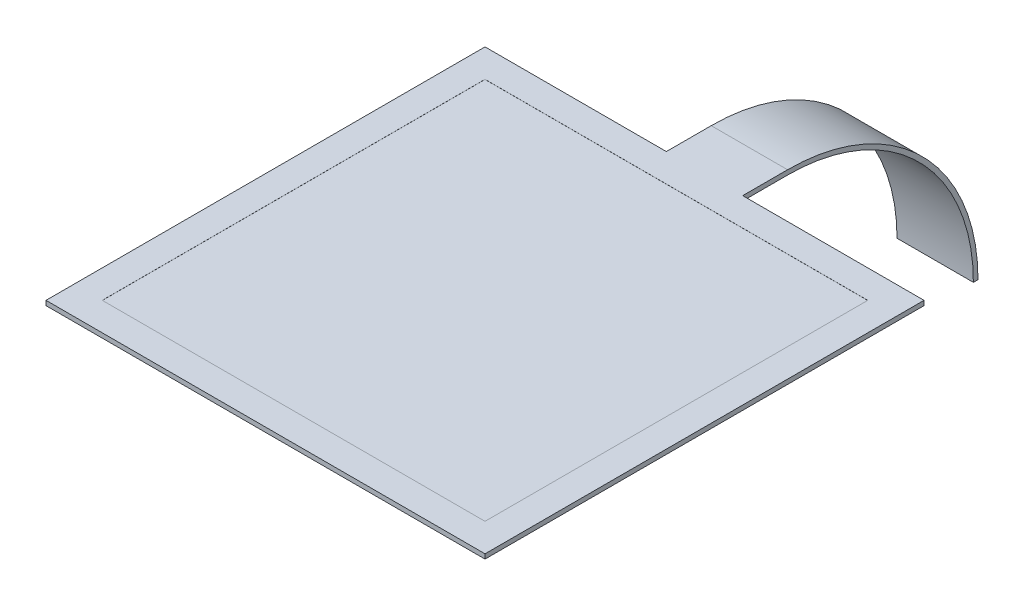
ISO-10303-21;
HEADER;
FILE_DESCRIPTION(('STEP AP214'),'2;1');
FILE_NAME('part.step','',(''),(''),'','','');
FILE_SCHEMA(('AUTOMOTIVE_DESIGN { 1 0 10303 214 1 1 1 1 }'));
ENDSEC;
DATA;
#1=APPLICATION_CONTEXT('core data for automotive mechanical design processes');
#2=APPLICATION_PROTOCOL_DEFINITION('international standard','automotive_design',2000,#1);
#3=PRODUCT_CONTEXT('',#1,'mechanical');
#4=PRODUCT('Part','Part','',(#3));
#5=PRODUCT_RELATED_PRODUCT_CATEGORY('part','',(#4));
#6=PRODUCT_DEFINITION_FORMATION('','',#4);
#7=PRODUCT_DEFINITION_CONTEXT('part definition',#1,'design');
#8=PRODUCT_DEFINITION('design','',#6,#7);
#9=PRODUCT_DEFINITION_SHAPE('','',#8);
#10=(LENGTH_UNIT() NAMED_UNIT(*) SI_UNIT(.MILLI.,.METRE.));
#11=(NAMED_UNIT(*) PLANE_ANGLE_UNIT() SI_UNIT($,.RADIAN.));
#12=(NAMED_UNIT(*) SI_UNIT($,.STERADIAN.) SOLID_ANGLE_UNIT());
#13=UNCERTAINTY_MEASURE_WITH_UNIT(LENGTH_MEASURE(1.E-05),#10,'distance_accuracy_value','');
#14=(GEOMETRIC_REPRESENTATION_CONTEXT(3) GLOBAL_UNCERTAINTY_ASSIGNED_CONTEXT((#13)) GLOBAL_UNIT_ASSIGNED_CONTEXT((#10,
#11,#12)) REPRESENTATION_CONTEXT('',''));
#15=CARTESIAN_POINT('',(0.,0.,0.));
#16=DIRECTION('',(0.,0.,1.));
#17=DIRECTION('',(1.,0.,0.));
#18=AXIS2_PLACEMENT_3D('',#15,#16,#17);
#19=CARTESIAN_POINT('',(21.85,0.23,21.85));
#20=DIRECTION('',(0.,1.,0.));
#21=DIRECTION('',(0.,0.,1.));
#22=AXIS2_PLACEMENT_3D('',#19,#20,#21);
#23=PLANE('',#22);
#24=DIRECTION('',(0.,0.,-1.));
#25=VECTOR('',#24,1.);
#26=CARTESIAN_POINT('',(19.05,0.23,19.05));
#27=LINE('',#26,#25);
#28=CARTESIAN_POINT('',(19.05,0.23,19.05));
#29=VERTEX_POINT('',#28);
#30=CARTESIAN_POINT('',(19.05,0.23,-19.05));
#31=VERTEX_POINT('',#30);
#32=EDGE_CURVE('E58',#29,#31,#27,.T.);
#33=ORIENTED_EDGE('',*,*,#32,.F.);
#34=DIRECTION('',(1.,0.,0.));
#35=VECTOR('',#34,1.);
#36=CARTESIAN_POINT('',(-19.05,0.23,19.05));
#37=LINE('',#36,#35);
#38=CARTESIAN_POINT('',(-19.05,0.23,19.05));
#39=VERTEX_POINT('',#38);
#40=EDGE_CURVE('E226',#39,#29,#37,.T.);
#41=ORIENTED_EDGE('',*,*,#40,.F.);
#42=DIRECTION('',(0.,0.,1.));
#43=VECTOR('',#42,1.);
#44=CARTESIAN_POINT('',(-19.05,0.23,19.05));
#45=LINE('',#44,#43);
#46=CARTESIAN_POINT('',(-19.05,0.23,-19.05));
#47=VERTEX_POINT('',#46);
#48=EDGE_CURVE('E240',#47,#39,#45,.T.);
#49=ORIENTED_EDGE('',*,*,#48,.F.);
#50=DIRECTION('',(-1.,0.,0.));
#51=VECTOR('',#50,1.);
#52=CARTESIAN_POINT('',(-19.05,0.23,-19.05));
#53=LINE('',#52,#51);
#54=EDGE_CURVE('E237',#31,#47,#53,.T.);
#55=ORIENTED_EDGE('',*,*,#54,.F.);
#56=EDGE_LOOP('',(#33,#41,#49,#55));
#57=FACE_BOUND('',#56,.T.);
#58=DIRECTION('',(0.,0.,-1.));
#59=VECTOR('',#58,1.);
#60=CARTESIAN_POINT('',(3.8,0.23,-21.85));
#61=LINE('',#60,#59);
#62=CARTESIAN_POINT('',(3.8,0.23,-21.85));
#63=VERTEX_POINT('',#62);
#64=CARTESIAN_POINT('',(3.8,0.230000000000001,-26.3155843490718));
#65=VERTEX_POINT('',#64);
#66=EDGE_CURVE('E153',#63,#65,#61,.T.);
#67=ORIENTED_EDGE('',*,*,#66,.T.);
#68=DIRECTION('',(1.,0.,0.));
#69=VECTOR('',#68,1.);
#70=CARTESIAN_POINT('',(-3.8,0.230000000000001,-26.3155843490718));
#71=LINE('',#70,#69);
#72=CARTESIAN_POINT('',(-3.8,0.230000000000001,-26.3155843490718));
#73=VERTEX_POINT('',#72);
#74=EDGE_CURVE('E141',#73,#65,#71,.T.);
#75=ORIENTED_EDGE('',*,*,#74,.F.);
#76=DIRECTION('',(0.,0.,1.));
#77=VECTOR('',#76,1.);
#78=CARTESIAN_POINT('',(-3.8,0.23,-21.85));
#79=LINE('',#78,#77);
#80=CARTESIAN_POINT('',(-3.8,0.23,-21.85));
#81=VERTEX_POINT('',#80);
#82=EDGE_CURVE('E150',#73,#81,#79,.T.);
#83=ORIENTED_EDGE('',*,*,#82,.T.);
#84=DIRECTION('',(-1.,0.,0.));
#85=VECTOR('',#84,1.);
#86=CARTESIAN_POINT('',(-21.85,0.23,-21.85));
#87=LINE('',#86,#85);
#88=CARTESIAN_POINT('',(-21.85,0.23,-21.85));
#89=VERTEX_POINT('',#88);
#90=EDGE_CURVE('E159',#81,#89,#87,.T.);
#91=ORIENTED_EDGE('',*,*,#90,.T.);
#92=DIRECTION('',(0.,0.,1.));
#93=VECTOR('',#92,1.);
#94=CARTESIAN_POINT('',(-21.85,0.23,-21.85));
#95=LINE('',#94,#93);
#96=CARTESIAN_POINT('',(-21.85,0.23,21.85));
#97=VERTEX_POINT('',#96);
#98=EDGE_CURVE('E161',#89,#97,#95,.T.);
#99=ORIENTED_EDGE('',*,*,#98,.T.);
#100=DIRECTION('',(1.,0.,0.));
#101=VECTOR('',#100,1.);
#102=CARTESIAN_POINT('',(-21.85,0.23,21.85));
#103=LINE('',#102,#101);
#104=CARTESIAN_POINT('',(21.85,0.23,21.85));
#105=VERTEX_POINT('',#104);
#106=EDGE_CURVE('E168',#97,#105,#103,.T.);
#107=ORIENTED_EDGE('',*,*,#106,.T.);
#108=DIRECTION('',(0.,0.,-1.));
#109=VECTOR('',#108,1.);
#110=CARTESIAN_POINT('',(21.85,0.23,-21.85));
#111=LINE('',#110,#109);
#112=CARTESIAN_POINT('',(21.85,0.23,-21.85));
#113=VERTEX_POINT('',#112);
#114=EDGE_CURVE('E188',#105,#113,#111,.T.);
#115=ORIENTED_EDGE('',*,*,#114,.T.);
#116=DIRECTION('',(-1.,0.,0.));
#117=VECTOR('',#116,1.);
#118=CARTESIAN_POINT('',(3.8,0.23,-21.85));
#119=LINE('',#118,#117);
#120=EDGE_CURVE('E163',#113,#63,#119,.T.);
#121=ORIENTED_EDGE('',*,*,#120,.T.);
#122=EDGE_LOOP('',(#67,#75,#83,#91,#99,#107,#115,#121));
#123=FACE_BOUND('',#122,.T.);
#124=ADVANCED_FACE('F35',(#57,#123),#23,.T.);
#125=CARTESIAN_POINT('',(21.85,-0.23,21.85));
#126=DIRECTION('',(0.,1.,0.));
#127=DIRECTION('',(0.,0.,1.));
#128=AXIS2_PLACEMENT_3D('',#125,#126,#127);
#129=PLANE('',#128);
#130=DIRECTION('',(-1.,0.,0.));
#131=VECTOR('',#130,1.);
#132=CARTESIAN_POINT('',(3.8,-0.230000000000001,-26.3155843490718));
#133=LINE('',#132,#131);
#134=CARTESIAN_POINT('',(3.8,-0.230000000000001,-26.3155843490718));
#135=VERTEX_POINT('',#134);
#136=CARTESIAN_POINT('',(-3.8,-0.23,-26.3155843490718));
#137=VERTEX_POINT('',#136);
#138=EDGE_CURVE('E209',#135,#137,#133,.T.);
#139=ORIENTED_EDGE('',*,*,#138,.F.);
#140=DIRECTION('',(0.,0.,-1.));
#141=VECTOR('',#140,1.);
#142=CARTESIAN_POINT('',(3.8,-0.23,-21.85));
#143=LINE('',#142,#141);
#144=CARTESIAN_POINT('',(3.8,-0.23,-21.85));
#145=VERTEX_POINT('',#144);
#146=EDGE_CURVE('E177',#145,#135,#143,.T.);
#147=ORIENTED_EDGE('',*,*,#146,.F.);
#148=DIRECTION('',(-1.,0.,0.));
#149=VECTOR('',#148,1.);
#150=CARTESIAN_POINT('',(3.8,-0.23,-21.85));
#151=LINE('',#150,#149);
#152=CARTESIAN_POINT('',(21.85,-0.23,-21.85));
#153=VERTEX_POINT('',#152);
#154=EDGE_CURVE('E174',#153,#145,#151,.T.);
#155=ORIENTED_EDGE('',*,*,#154,.F.);
#156=DIRECTION('',(0.,0.,-1.));
#157=VECTOR('',#156,1.);
#158=CARTESIAN_POINT('',(21.85,-0.23,-21.85));
#159=LINE('',#158,#157);
#160=CARTESIAN_POINT('',(21.85,-0.23,21.85));
#161=VERTEX_POINT('',#160);
#162=EDGE_CURVE('E171',#161,#153,#159,.T.);
#163=ORIENTED_EDGE('',*,*,#162,.F.);
#164=DIRECTION('',(1.,0.,0.));
#165=VECTOR('',#164,1.);
#166=CARTESIAN_POINT('',(-21.85,-0.23,21.85));
#167=LINE('',#166,#165);
#168=CARTESIAN_POINT('',(-21.85,-0.23,21.85));
#169=VERTEX_POINT('',#168);
#170=EDGE_CURVE('E186',#169,#161,#167,.T.);
#171=ORIENTED_EDGE('',*,*,#170,.F.);
#172=DIRECTION('',(0.,0.,1.));
#173=VECTOR('',#172,1.);
#174=CARTESIAN_POINT('',(-21.85,-0.23,-21.85));
#175=LINE('',#174,#173);
#176=CARTESIAN_POINT('',(-21.85,-0.23,-21.85));
#177=VERTEX_POINT('',#176);
#178=EDGE_CURVE('E184',#177,#169,#175,.T.);
#179=ORIENTED_EDGE('',*,*,#178,.F.);
#180=DIRECTION('',(-1.,0.,0.));
#181=VECTOR('',#180,1.);
#182=CARTESIAN_POINT('',(-21.85,-0.23,-21.85));
#183=LINE('',#182,#181);
#184=CARTESIAN_POINT('',(-3.8,-0.23,-21.85));
#185=VERTEX_POINT('',#184);
#186=EDGE_CURVE('E182',#185,#177,#183,.T.);
#187=ORIENTED_EDGE('',*,*,#186,.F.);
#188=DIRECTION('',(0.,0.,1.));
#189=VECTOR('',#188,1.);
#190=CARTESIAN_POINT('',(-3.8,-0.23,-21.85));
#191=LINE('',#190,#189);
#192=EDGE_CURVE('E180',#137,#185,#191,.T.);
#193=ORIENTED_EDGE('',*,*,#192,.F.);
#194=EDGE_LOOP('',(#139,#147,#155,#163,#171,#179,#187,#193));
#195=FACE_BOUND('',#194,.T.);
#196=ADVANCED_FACE('F206',(#195),#129,.F.);
#197=CARTESIAN_POINT('',(21.85,0.23,-21.85));
#198=DIRECTION('',(-1.,0.,0.));
#199=DIRECTION('',(0.,0.,1.));
#200=AXIS2_PLACEMENT_3D('',#197,#198,#199);
#201=PLANE('',#200);
#202=ORIENTED_EDGE('',*,*,#162,.T.);
#203=DIRECTION('',(0.,-1.,0.));
#204=VECTOR('',#203,1.);
#205=CARTESIAN_POINT('',(21.85,0.23,-21.85));
#206=LINE('',#205,#204);
#207=EDGE_CURVE('E11',#113,#153,#206,.T.);
#208=ORIENTED_EDGE('',*,*,#207,.F.);
#209=ORIENTED_EDGE('',*,*,#114,.F.);
#210=DIRECTION('',(0.,-1.,0.));
#211=VECTOR('',#210,1.);
#212=CARTESIAN_POINT('',(21.85,0.23,21.85));
#213=LINE('',#212,#211);
#214=EDGE_CURVE('E170',#105,#161,#213,.T.);
#215=ORIENTED_EDGE('',*,*,#214,.T.);
#216=EDGE_LOOP('',(#202,#208,#209,#215));
#217=FACE_BOUND('',#216,.T.);
#218=ADVANCED_FACE('F37',(#217),#201,.F.);
#219=CARTESIAN_POINT('',(3.8,0.23,-21.85));
#220=DIRECTION('',(0.,0.,1.));
#221=DIRECTION('',(1.,0.,0.));
#222=AXIS2_PLACEMENT_3D('',#219,#220,#221);
#223=PLANE('',#222);
#224=ORIENTED_EDGE('',*,*,#154,.T.);
#225=DIRECTION('',(0.,-1.,0.));
#226=VECTOR('',#225,1.);
#227=CARTESIAN_POINT('',(3.8,0.23,-21.85));
#228=LINE('',#227,#226);
#229=EDGE_CURVE('E43',#63,#145,#228,.T.);
#230=ORIENTED_EDGE('',*,*,#229,.F.);
#231=ORIENTED_EDGE('',*,*,#120,.F.);
#232=ORIENTED_EDGE('',*,*,#207,.T.);
#233=EDGE_LOOP('',(#224,#230,#231,#232));
#234=FACE_BOUND('',#233,.T.);
#235=ADVANCED_FACE('F254',(#234),#223,.F.);
#236=CARTESIAN_POINT('',(3.8,0.23,-21.85));
#237=DIRECTION('',(-1.,0.,0.));
#238=DIRECTION('',(0.,0.,1.));
#239=AXIS2_PLACEMENT_3D('',#236,#237,#238);
#240=PLANE('',#239);
#241=CARTESIAN_POINT('',(3.8,-18.7262837167438,-26.3155843490718));
#242=DIRECTION('',(1.,0.,0.));
#243=DIRECTION('',(0.,0.,1.));
#244=AXIS2_PLACEMENT_3D('',#241,#242,#243);
#245=CIRCLE('',#244,18.9562837167438);
#246=CARTESIAN_POINT('',(3.8,-18.7262837167438,-45.2718680658157));
#247=VERTEX_POINT('',#246);
#248=EDGE_CURVE('E212',#247,#65,#245,.T.);
#249=ORIENTED_EDGE('',*,*,#248,.T.);
#250=ORIENTED_EDGE('',*,*,#66,.F.);
#251=ORIENTED_EDGE('',*,*,#229,.T.);
#252=ORIENTED_EDGE('',*,*,#146,.T.);
#253=CARTESIAN_POINT('',(3.8,-18.7262837167438,-26.3155843490718));
#254=DIRECTION('',(-1.,0.,0.));
#255=DIRECTION('',(0.,0.,1.));
#256=AXIS2_PLACEMENT_3D('',#253,#254,#255);
#257=CIRCLE('',#256,18.4962837167438);
#258=CARTESIAN_POINT('',(3.8,-18.7262837167438,-44.8118680658157));
#259=VERTEX_POINT('',#258);
#260=EDGE_CURVE('E146',#135,#259,#257,.T.);
#261=ORIENTED_EDGE('',*,*,#260,.T.);
#262=DIRECTION('',(0.,0.,-1.));
#263=VECTOR('',#262,1.);
#264=CARTESIAN_POINT('',(3.8,-18.7262837167438,-44.8118680658157));
#265=LINE('',#264,#263);
#266=EDGE_CURVE('E216',#259,#247,#265,.T.);
#267=ORIENTED_EDGE('',*,*,#266,.T.);
#268=EDGE_LOOP('',(#249,#250,#251,#252,#261,#267));
#269=FACE_BOUND('',#268,.T.);
#270=ADVANCED_FACE('F201',(#269),#240,.F.);
#271=CARTESIAN_POINT('',(-3.8,0.23,-21.85));
#272=DIRECTION('',(1.,0.,0.));
#273=DIRECTION('',(0.,0.,-1.));
#274=AXIS2_PLACEMENT_3D('',#271,#272,#273);
#275=PLANE('',#274);
#276=ORIENTED_EDGE('',*,*,#82,.F.);
#277=CARTESIAN_POINT('',(-3.8,-18.7262837167438,-26.3155843490718));
#278=DIRECTION('',(1.,0.,0.));
#279=DIRECTION('',(0.,0.,1.));
#280=AXIS2_PLACEMENT_3D('',#277,#278,#279);
#281=CIRCLE('',#280,18.9562837167438);
#282=CARTESIAN_POINT('',(-3.8,-18.7262837167438,-45.2718680658157));
#283=VERTEX_POINT('',#282);
#284=EDGE_CURVE('E137',#283,#73,#281,.T.);
#285=ORIENTED_EDGE('',*,*,#284,.F.);
#286=DIRECTION('',(0.,0.,-1.));
#287=VECTOR('',#286,1.);
#288=CARTESIAN_POINT('',(-3.8,-18.7262837167438,-44.8118680658157));
#289=LINE('',#288,#287);
#290=CARTESIAN_POINT('',(-3.8,-18.7262837167438,-44.8118680658157));
#291=VERTEX_POINT('',#290);
#292=EDGE_CURVE('E147',#291,#283,#289,.T.);
#293=ORIENTED_EDGE('',*,*,#292,.F.);
#294=CARTESIAN_POINT('',(-3.8,-18.7262837167438,-26.3155843490718));
#295=DIRECTION('',(-1.,0.,0.));
#296=DIRECTION('',(0.,0.,1.));
#297=AXIS2_PLACEMENT_3D('',#294,#295,#296);
#298=CIRCLE('',#297,18.4962837167438);
#299=EDGE_CURVE('E50',#137,#291,#298,.T.);
#300=ORIENTED_EDGE('',*,*,#299,.F.);
#301=ORIENTED_EDGE('',*,*,#192,.T.);
#302=DIRECTION('',(0.,-1.,0.));
#303=VECTOR('',#302,1.);
#304=CARTESIAN_POINT('',(-3.8,0.23,-21.85));
#305=LINE('',#304,#303);
#306=EDGE_CURVE('E157',#81,#185,#305,.T.);
#307=ORIENTED_EDGE('',*,*,#306,.F.);
#308=EDGE_LOOP('',(#276,#285,#293,#300,#301,#307));
#309=FACE_BOUND('',#308,.T.);
#310=ADVANCED_FACE('F155',(#309),#275,.F.);
#311=CARTESIAN_POINT('',(-21.85,0.23,-21.85));
#312=DIRECTION('',(0.,0.,1.));
#313=DIRECTION('',(1.,0.,0.));
#314=AXIS2_PLACEMENT_3D('',#311,#312,#313);
#315=PLANE('',#314);
#316=ORIENTED_EDGE('',*,*,#186,.T.);
#317=DIRECTION('',(0.,-1.,0.));
#318=VECTOR('',#317,1.);
#319=CARTESIAN_POINT('',(-21.85,0.23,-21.85));
#320=LINE('',#319,#318);
#321=EDGE_CURVE('E194',#89,#177,#320,.T.);
#322=ORIENTED_EDGE('',*,*,#321,.F.);
#323=ORIENTED_EDGE('',*,*,#90,.F.);
#324=ORIENTED_EDGE('',*,*,#306,.T.);
#325=EDGE_LOOP('',(#316,#322,#323,#324));
#326=FACE_BOUND('',#325,.T.);
#327=ADVANCED_FACE('F268',(#326),#315,.F.);
#328=CARTESIAN_POINT('',(-21.85,0.23,-21.85));
#329=DIRECTION('',(1.,0.,0.));
#330=DIRECTION('',(0.,0.,-1.));
#331=AXIS2_PLACEMENT_3D('',#328,#329,#330);
#332=PLANE('',#331);
#333=ORIENTED_EDGE('',*,*,#178,.T.);
#334=DIRECTION('',(0.,-1.,0.));
#335=VECTOR('',#334,1.);
#336=CARTESIAN_POINT('',(-21.85,0.23,21.85));
#337=LINE('',#336,#335);
#338=EDGE_CURVE('E191',#97,#169,#337,.T.);
#339=ORIENTED_EDGE('',*,*,#338,.F.);
#340=ORIENTED_EDGE('',*,*,#98,.F.);
#341=ORIENTED_EDGE('',*,*,#321,.T.);
#342=EDGE_LOOP('',(#333,#339,#340,#341));
#343=FACE_BOUND('',#342,.T.);
#344=ADVANCED_FACE('F265',(#343),#332,.F.);
#345=CARTESIAN_POINT('',(-21.85,0.23,21.85));
#346=DIRECTION('',(0.,0.,-1.));
#347=DIRECTION('',(-1.,0.,0.));
#348=AXIS2_PLACEMENT_3D('',#345,#346,#347);
#349=PLANE('',#348);
#350=ORIENTED_EDGE('',*,*,#170,.T.);
#351=ORIENTED_EDGE('',*,*,#214,.F.);
#352=ORIENTED_EDGE('',*,*,#106,.F.);
#353=ORIENTED_EDGE('',*,*,#338,.T.);
#354=EDGE_LOOP('',(#350,#351,#352,#353));
#355=FACE_BOUND('',#354,.T.);
#356=ADVANCED_FACE('F260',(#355),#349,.F.);
#357=CARTESIAN_POINT('',(19.05,0.22,19.05));
#358=DIRECTION('',(1.,0.,0.));
#359=DIRECTION('',(0.,0.,-1.));
#360=AXIS2_PLACEMENT_3D('',#357,#358,#359);
#361=PLANE('',#360);
#362=ORIENTED_EDGE('',*,*,#32,.T.);
#363=DIRECTION('',(0.,1.,0.));
#364=VECTOR('',#363,1.);
#365=CARTESIAN_POINT('',(19.05,0.22,-19.05));
#366=LINE('',#365,#364);
#367=CARTESIAN_POINT('',(19.05,0.22,-19.05));
#368=VERTEX_POINT('',#367);
#369=EDGE_CURVE('E235',#368,#31,#366,.T.);
#370=ORIENTED_EDGE('',*,*,#369,.F.);
#371=DIRECTION('',(0.,0.,-1.));
#372=VECTOR('',#371,1.);
#373=CARTESIAN_POINT('',(19.05,0.22,19.05));
#374=LINE('',#373,#372);
#375=CARTESIAN_POINT('',(19.05,0.22,19.05));
#376=VERTEX_POINT('',#375);
#377=EDGE_CURVE('E222',#376,#368,#374,.T.);
#378=ORIENTED_EDGE('',*,*,#377,.F.);
#379=DIRECTION('',(0.,1.,0.));
#380=VECTOR('',#379,1.);
#381=CARTESIAN_POINT('',(19.05,0.22,19.05));
#382=LINE('',#381,#380);
#383=EDGE_CURVE('E175',#376,#29,#382,.T.);
#384=ORIENTED_EDGE('',*,*,#383,.T.);
#385=EDGE_LOOP('',(#362,#370,#378,#384));
#386=FACE_BOUND('',#385,.T.);
#387=ADVANCED_FACE('F288',(#386),#361,.F.);
#388=CARTESIAN_POINT('',(-19.05,0.22,19.05));
#389=DIRECTION('',(0.,0.,1.));
#390=DIRECTION('',(1.,0.,0.));
#391=AXIS2_PLACEMENT_3D('',#388,#389,#390);
#392=PLANE('',#391);
#393=ORIENTED_EDGE('',*,*,#40,.T.);
#394=ORIENTED_EDGE('',*,*,#383,.F.);
#395=DIRECTION('',(1.,0.,0.));
#396=VECTOR('',#395,1.);
#397=CARTESIAN_POINT('',(-19.05,0.22,19.05));
#398=LINE('',#397,#396);
#399=CARTESIAN_POINT('',(-19.05,0.22,19.05));
#400=VERTEX_POINT('',#399);
#401=EDGE_CURVE('E232',#400,#376,#398,.T.);
#402=ORIENTED_EDGE('',*,*,#401,.F.);
#403=DIRECTION('',(0.,1.,0.));
#404=VECTOR('',#403,1.);
#405=CARTESIAN_POINT('',(-19.05,0.22,19.05));
#406=LINE('',#405,#404);
#407=EDGE_CURVE('E246',#400,#39,#406,.T.);
#408=ORIENTED_EDGE('',*,*,#407,.T.);
#409=EDGE_LOOP('',(#393,#394,#402,#408));
#410=FACE_BOUND('',#409,.T.);
#411=ADVANCED_FACE('F295',(#410),#392,.F.);
#412=CARTESIAN_POINT('',(-19.05,0.22,19.05));
#413=DIRECTION('',(-1.,0.,0.));
#414=DIRECTION('',(0.,0.,1.));
#415=AXIS2_PLACEMENT_3D('',#412,#413,#414);
#416=PLANE('',#415);
#417=ORIENTED_EDGE('',*,*,#48,.T.);
#418=ORIENTED_EDGE('',*,*,#407,.F.);
#419=DIRECTION('',(0.,0.,1.));
#420=VECTOR('',#419,1.);
#421=CARTESIAN_POINT('',(-19.05,0.22,19.05));
#422=LINE('',#421,#420);
#423=CARTESIAN_POINT('',(-19.05,0.22,-19.05));
#424=VERTEX_POINT('',#423);
#425=EDGE_CURVE('E229',#424,#400,#422,.T.);
#426=ORIENTED_EDGE('',*,*,#425,.F.);
#427=DIRECTION('',(0.,1.,0.));
#428=VECTOR('',#427,1.);
#429=CARTESIAN_POINT('',(-19.05,0.22,-19.05));
#430=LINE('',#429,#428);
#431=EDGE_CURVE('E248',#424,#47,#430,.T.);
#432=ORIENTED_EDGE('',*,*,#431,.T.);
#433=EDGE_LOOP('',(#417,#418,#426,#432));
#434=FACE_BOUND('',#433,.T.);
#435=ADVANCED_FACE('F299',(#434),#416,.F.);
#436=CARTESIAN_POINT('',(-19.05,0.22,-19.05));
#437=DIRECTION('',(0.,0.,-1.));
#438=DIRECTION('',(-1.,0.,0.));
#439=AXIS2_PLACEMENT_3D('',#436,#437,#438);
#440=PLANE('',#439);
#441=ORIENTED_EDGE('',*,*,#54,.T.);
#442=ORIENTED_EDGE('',*,*,#431,.F.);
#443=DIRECTION('',(-1.,0.,0.));
#444=VECTOR('',#443,1.);
#445=CARTESIAN_POINT('',(-19.05,0.22,-19.05));
#446=LINE('',#445,#444);
#447=EDGE_CURVE('E225',#368,#424,#446,.T.);
#448=ORIENTED_EDGE('',*,*,#447,.F.);
#449=ORIENTED_EDGE('',*,*,#369,.T.);
#450=EDGE_LOOP('',(#441,#442,#448,#449));
#451=FACE_BOUND('',#450,.T.);
#452=ADVANCED_FACE('F305',(#451),#440,.F.);
#453=CARTESIAN_POINT('',(19.05,0.22,-19.05));
#454=DIRECTION('',(0.,-1.,0.));
#455=DIRECTION('',(0.,0.,-1.));
#456=AXIS2_PLACEMENT_3D('',#453,#454,#455);
#457=PLANE('',#456);
#458=ORIENTED_EDGE('',*,*,#377,.T.);
#459=ORIENTED_EDGE('',*,*,#447,.T.);
#460=ORIENTED_EDGE('',*,*,#425,.T.);
#461=ORIENTED_EDGE('',*,*,#401,.T.);
#462=EDGE_LOOP('',(#458,#459,#460,#461));
#463=FACE_BOUND('',#462,.T.);
#464=ADVANCED_FACE('F309',(#463),#457,.F.);
#465=CARTESIAN_POINT('',(3.8,-18.7262837167438,-26.3155843490718));
#466=DIRECTION('',(-1.,0.,0.));
#467=DIRECTION('',(0.,0.,1.));
#468=AXIS2_PLACEMENT_3D('',#465,#466,#467);
#469=CYLINDRICAL_SURFACE('',#468,18.9562837167438);
#470=ORIENTED_EDGE('',*,*,#284,.T.);
#471=ORIENTED_EDGE('',*,*,#74,.T.);
#472=ORIENTED_EDGE('',*,*,#248,.F.);
#473=DIRECTION('',(-1.,0.,0.));
#474=VECTOR('',#473,1.);
#475=CARTESIAN_POINT('',(3.8,-18.7262837167438,-45.2718680658157));
#476=LINE('',#475,#474);
#477=EDGE_CURVE('E144',#247,#283,#476,.T.);
#478=ORIENTED_EDGE('',*,*,#477,.T.);
#479=EDGE_LOOP('',(#470,#471,#472,#478));
#480=FACE_BOUND('',#479,.T.);
#481=ADVANCED_FACE('F139',(#480),#469,.T.);
#482=CARTESIAN_POINT('',(3.8,-18.7262837167438,-26.3155843490718));
#483=DIRECTION('',(-1.,0.,0.));
#484=DIRECTION('',(0.,0.,1.));
#485=AXIS2_PLACEMENT_3D('',#482,#483,#484);
#486=CYLINDRICAL_SURFACE('',#485,18.4962837167438);
#487=ORIENTED_EDGE('',*,*,#299,.T.);
#488=DIRECTION('',(-1.,0.,0.));
#489=VECTOR('',#488,1.);
#490=CARTESIAN_POINT('',(3.8,-18.7262837167438,-44.8118680658157));
#491=LINE('',#490,#489);
#492=EDGE_CURVE('E214',#259,#291,#491,.T.);
#493=ORIENTED_EDGE('',*,*,#492,.F.);
#494=ORIENTED_EDGE('',*,*,#260,.F.);
#495=ORIENTED_EDGE('',*,*,#138,.T.);
#496=EDGE_LOOP('',(#487,#493,#494,#495));
#497=FACE_BOUND('',#496,.T.);
#498=ADVANCED_FACE('F328',(#497),#486,.F.);
#499=CARTESIAN_POINT('',(3.8,-18.7262837167438,-44.8118680658157));
#500=DIRECTION('',(0.,1.,0.));
#501=DIRECTION('',(0.,0.,1.));
#502=AXIS2_PLACEMENT_3D('',#499,#500,#501);
#503=PLANE('',#502);
#504=ORIENTED_EDGE('',*,*,#292,.T.);
#505=ORIENTED_EDGE('',*,*,#477,.F.);
#506=ORIENTED_EDGE('',*,*,#266,.F.);
#507=ORIENTED_EDGE('',*,*,#492,.T.);
#508=EDGE_LOOP('',(#504,#505,#506,#507));
#509=FACE_BOUND('',#508,.T.);
#510=ADVANCED_FACE('F333',(#509),#503,.F.);
#511=CLOSED_SHELL('',(#124,#196,#218,#235,#270,#310,#327,#344,#356,#387,#411,#435,#452,#464,
#481,#498,#510));
#512=MANIFOLD_SOLID_BREP('B2',#511);
#513=ADVANCED_BREP_SHAPE_REPRESENTATION('',(#18,#512),#14);
#514=SHAPE_DEFINITION_REPRESENTATION(#9,#513);
ENDSEC;
END-ISO-10303-21;
